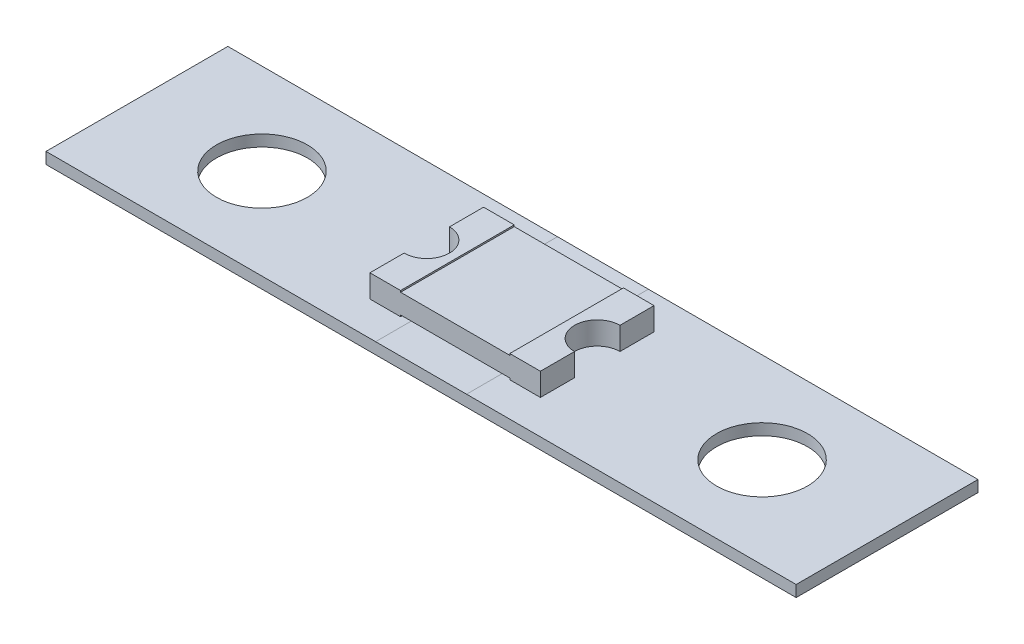
ISO-10303-21;
HEADER;
FILE_DESCRIPTION(('STEP AP214'),'2;1');
FILE_NAME('part.step','',(''),(''),'','','');
FILE_SCHEMA(('AUTOMOTIVE_DESIGN { 1 0 10303 214 1 1 1 1 }'));
ENDSEC;
DATA;
#1=APPLICATION_CONTEXT('core data for automotive mechanical design processes');
#2=APPLICATION_PROTOCOL_DEFINITION('international standard','automotive_design',2000,#1);
#3=PRODUCT_CONTEXT('',#1,'mechanical');
#4=PRODUCT('Part','Part','',(#3));
#5=PRODUCT_RELATED_PRODUCT_CATEGORY('part','',(#4));
#6=PRODUCT_DEFINITION_FORMATION('','',#4);
#7=PRODUCT_DEFINITION_CONTEXT('part definition',#1,'design');
#8=PRODUCT_DEFINITION('design','',#6,#7);
#9=PRODUCT_DEFINITION_SHAPE('','',#8);
#10=(LENGTH_UNIT() NAMED_UNIT(*) SI_UNIT(.MILLI.,.METRE.));
#11=(NAMED_UNIT(*) PLANE_ANGLE_UNIT() SI_UNIT($,.RADIAN.));
#12=(NAMED_UNIT(*) SI_UNIT($,.STERADIAN.) SOLID_ANGLE_UNIT());
#13=UNCERTAINTY_MEASURE_WITH_UNIT(LENGTH_MEASURE(1.E-05),#10,'distance_accuracy_value','');
#14=(GEOMETRIC_REPRESENTATION_CONTEXT(3) GLOBAL_UNCERTAINTY_ASSIGNED_CONTEXT((#13)) GLOBAL_UNIT_ASSIGNED_CONTEXT((#10,
#11,#12)) REPRESENTATION_CONTEXT('',''));
#15=CARTESIAN_POINT('',(0.,0.,0.));
#16=DIRECTION('',(0.,0.,1.));
#17=DIRECTION('',(1.,0.,0.));
#18=AXIS2_PLACEMENT_3D('',#15,#16,#17);
#19=CARTESIAN_POINT('',(0.,1.5,0.));
#20=DIRECTION('',(0.,1.,0.));
#21=DIRECTION('',(0.,0.,1.));
#22=AXIS2_PLACEMENT_3D('',#19,#20,#21);
#23=PLANE('',#22);
#24=DIRECTION('',(0.,0.,1.));
#25=VECTOR('',#24,1.);
#26=CARTESIAN_POINT('',(-2.40178605763674,1.5,0.));
#27=LINE('',#26,#25);
#28=CARTESIAN_POINT('',(-2.40178605763674,1.5,-2.5));
#29=VERTEX_POINT('',#28);
#30=CARTESIAN_POINT('',(-2.40178605763674,1.5,2.5));
#31=VERTEX_POINT('',#30);
#32=EDGE_CURVE('E12',#29,#31,#27,.T.);
#33=ORIENTED_EDGE('',*,*,#32,.F.);
#34=DIRECTION('',(1.,0.,0.));
#35=VECTOR('',#34,1.);
#36=CARTESIAN_POINT('',(0.,1.5,-2.5));
#37=LINE('',#36,#35);
#38=CARTESIAN_POINT('',(-3.75,1.5,-2.5));
#39=VERTEX_POINT('',#38);
#40=EDGE_CURVE('E223',#39,#29,#37,.T.);
#41=ORIENTED_EDGE('',*,*,#40,.F.);
#42=DIRECTION('',(0.,0.,-1.));
#43=VECTOR('',#42,1.);
#44=CARTESIAN_POINT('',(-3.75,1.5,0.));
#45=LINE('',#44,#43);
#46=CARTESIAN_POINT('',(-3.75,1.5,-1.));
#47=VERTEX_POINT('',#46);
#48=EDGE_CURVE('E226',#47,#39,#45,.T.);
#49=ORIENTED_EDGE('',*,*,#48,.F.);
#50=CARTESIAN_POINT('',(-3.75,1.5,0.));
#51=DIRECTION('',(0.,1.,0.));
#52=DIRECTION('',(0.,0.,1.));
#53=AXIS2_PLACEMENT_3D('',#50,#51,#52);
#54=CIRCLE('',#53,1.);
#55=CARTESIAN_POINT('',(-3.75,1.5,1.));
#56=VERTEX_POINT('',#55);
#57=EDGE_CURVE('E229',#56,#47,#54,.T.);
#58=ORIENTED_EDGE('',*,*,#57,.F.);
#59=CARTESIAN_POINT('',(-3.75,1.5,2.5));
#60=VERTEX_POINT('',#59);
#61=EDGE_CURVE('E230',#60,#56,#45,.T.);
#62=ORIENTED_EDGE('',*,*,#61,.F.);
#63=DIRECTION('',(1.,0.,0.));
#64=VECTOR('',#63,1.);
#65=CARTESIAN_POINT('',(0.,1.5,2.5));
#66=LINE('',#65,#64);
#67=EDGE_CURVE('E233',#60,#31,#66,.T.);
#68=ORIENTED_EDGE('',*,*,#67,.T.);
#69=EDGE_LOOP('',(#33,#41,#49,#58,#62,#68));
#70=FACE_BOUND('',#69,.T.);
#71=ADVANCED_FACE('F52',(#70),#23,.T.);
#72=CARTESIAN_POINT('',(0.,0.5,0.));
#73=DIRECTION('',(0.,1.,0.));
#74=DIRECTION('',(0.,0.,1.));
#75=AXIS2_PLACEMENT_3D('',#72,#73,#74);
#76=PLANE('',#75);
#77=DIRECTION('',(1.,0.,0.));
#78=VECTOR('',#77,1.);
#79=CARTESIAN_POINT('',(0.,0.5,-2.5));
#80=LINE('',#79,#78);
#81=CARTESIAN_POINT('',(-3.75,0.5,-2.5));
#82=VERTEX_POINT('',#81);
#83=CARTESIAN_POINT('',(-2.40178605763674,0.5,-2.5));
#84=VERTEX_POINT('',#83);
#85=EDGE_CURVE('E242',#82,#84,#80,.T.);
#86=ORIENTED_EDGE('',*,*,#85,.T.);
#87=DIRECTION('',(0.,0.,1.));
#88=VECTOR('',#87,1.);
#89=CARTESIAN_POINT('',(-2.40178605763674,0.5,0.));
#90=LINE('',#89,#88);
#91=CARTESIAN_POINT('',(-2.40178605763674,0.5,2.5));
#92=VERTEX_POINT('',#91);
#93=EDGE_CURVE('E276',#84,#92,#90,.T.);
#94=ORIENTED_EDGE('',*,*,#93,.T.);
#95=DIRECTION('',(1.,0.,0.));
#96=VECTOR('',#95,1.);
#97=CARTESIAN_POINT('',(0.,0.5,2.5));
#98=LINE('',#97,#96);
#99=CARTESIAN_POINT('',(-3.75,0.5,2.5));
#100=VERTEX_POINT('',#99);
#101=EDGE_CURVE('E252',#100,#92,#98,.T.);
#102=ORIENTED_EDGE('',*,*,#101,.F.);
#103=DIRECTION('',(0.,0.,-1.));
#104=VECTOR('',#103,1.);
#105=CARTESIAN_POINT('',(-3.75,0.5,0.));
#106=LINE('',#105,#104);
#107=CARTESIAN_POINT('',(-3.75,0.5,1.));
#108=VERTEX_POINT('',#107);
#109=EDGE_CURVE('E249',#100,#108,#106,.T.);
#110=ORIENTED_EDGE('',*,*,#109,.T.);
#111=CARTESIAN_POINT('',(-3.75,0.5,0.));
#112=DIRECTION('',(0.,1.,0.));
#113=DIRECTION('',(0.,0.,1.));
#114=AXIS2_PLACEMENT_3D('',#111,#112,#113);
#115=CIRCLE('',#114,1.);
#116=CARTESIAN_POINT('',(-3.75,0.5,-1.));
#117=VERTEX_POINT('',#116);
#118=EDGE_CURVE('E248',#108,#117,#115,.T.);
#119=ORIENTED_EDGE('',*,*,#118,.T.);
#120=EDGE_CURVE('E245',#117,#82,#106,.T.);
#121=ORIENTED_EDGE('',*,*,#120,.T.);
#122=EDGE_LOOP('',(#86,#94,#102,#110,#119,#121));
#123=FACE_BOUND('',#122,.T.);
#124=ADVANCED_FACE('F310',(#123),#76,.F.);
#125=CARTESIAN_POINT('',(3.75,1.5,0.));
#126=DIRECTION('',(0.,-1.,0.));
#127=DIRECTION('',(0.,0.,-1.));
#128=AXIS2_PLACEMENT_3D('',#125,#126,#127);
#129=CYLINDRICAL_SURFACE('',#128,1.);
#130=CARTESIAN_POINT('',(3.75,0.5,0.));
#131=DIRECTION('',(0.,1.,0.));
#132=DIRECTION('',(0.,0.,1.));
#133=AXIS2_PLACEMENT_3D('',#130,#131,#132);
#134=CIRCLE('',#133,1.);
#135=CARTESIAN_POINT('',(3.75,0.5,-1.));
#136=VERTEX_POINT('',#135);
#137=CARTESIAN_POINT('',(3.75,0.5,1.));
#138=VERTEX_POINT('',#137);
#139=EDGE_CURVE('E213',#136,#138,#134,.T.);
#140=ORIENTED_EDGE('',*,*,#139,.F.);
#141=DIRECTION('',(0.,-1.,0.));
#142=VECTOR('',#141,1.);
#143=CARTESIAN_POINT('',(3.75,1.5,-1.));
#144=LINE('',#143,#142);
#145=CARTESIAN_POINT('',(3.75,1.5,-1.));
#146=VERTEX_POINT('',#145);
#147=EDGE_CURVE('E272',#146,#136,#144,.T.);
#148=ORIENTED_EDGE('',*,*,#147,.F.);
#149=CARTESIAN_POINT('',(3.75,1.5,0.));
#150=DIRECTION('',(0.,1.,0.));
#151=DIRECTION('',(0.,0.,1.));
#152=AXIS2_PLACEMENT_3D('',#149,#150,#151);
#153=CIRCLE('',#152,1.);
#154=CARTESIAN_POINT('',(3.75,1.5,1.));
#155=VERTEX_POINT('',#154);
#156=EDGE_CURVE('E214',#146,#155,#153,.T.);
#157=ORIENTED_EDGE('',*,*,#156,.T.);
#158=DIRECTION('',(0.,-1.,0.));
#159=VECTOR('',#158,1.);
#160=CARTESIAN_POINT('',(3.75,1.5,1.));
#161=LINE('',#160,#159);
#162=EDGE_CURVE('E256',#155,#138,#161,.T.);
#163=ORIENTED_EDGE('',*,*,#162,.T.);
#164=EDGE_LOOP('',(#140,#148,#157,#163));
#165=FACE_BOUND('',#164,.T.);
#166=ADVANCED_FACE('F54',(#165),#129,.F.);
#167=CARTESIAN_POINT('',(3.75,1.5,0.));
#168=DIRECTION('',(-1.,0.,0.));
#169=DIRECTION('',(0.,0.,1.));
#170=AXIS2_PLACEMENT_3D('',#167,#168,#169);
#171=PLANE('',#170);
#172=DIRECTION('',(0.,0.,-1.));
#173=VECTOR('',#172,1.);
#174=CARTESIAN_POINT('',(3.75,0.5,0.));
#175=LINE('',#174,#173);
#176=CARTESIAN_POINT('',(3.75,0.5,-2.5));
#177=VERTEX_POINT('',#176);
#178=EDGE_CURVE('E238',#136,#177,#175,.T.);
#179=ORIENTED_EDGE('',*,*,#178,.T.);
#180=DIRECTION('',(0.,-1.,0.));
#181=VECTOR('',#180,1.);
#182=CARTESIAN_POINT('',(3.75,1.5,-2.5));
#183=LINE('',#182,#181);
#184=CARTESIAN_POINT('',(3.75,1.5,-2.5));
#185=VERTEX_POINT('',#184);
#186=EDGE_CURVE('E269',#185,#177,#183,.T.);
#187=ORIENTED_EDGE('',*,*,#186,.F.);
#188=DIRECTION('',(0.,0.,-1.));
#189=VECTOR('',#188,1.);
#190=CARTESIAN_POINT('',(3.75,1.5,0.));
#191=LINE('',#190,#189);
#192=EDGE_CURVE('E217',#146,#185,#191,.T.);
#193=ORIENTED_EDGE('',*,*,#192,.F.);
#194=ORIENTED_EDGE('',*,*,#147,.T.);
#195=EDGE_LOOP('',(#179,#187,#193,#194));
#196=FACE_BOUND('',#195,.T.);
#197=ADVANCED_FACE('F289',(#196),#171,.F.);
#198=CARTESIAN_POINT('',(0.,1.5,-2.5));
#199=DIRECTION('',(0.,0.,-1.));
#200=DIRECTION('',(-1.,0.,0.));
#201=AXIS2_PLACEMENT_3D('',#198,#199,#200);
#202=PLANE('',#201);
#203=DIRECTION('',(0.,1.,0.));
#204=VECTOR('',#203,1.);
#205=CARTESIAN_POINT('',(-2.40178605763674,1.5,-2.5));
#206=LINE('',#205,#204);
#207=CARTESIAN_POINT('',(-2.40178605763674,1.43207417273462,-2.5));
#208=VERTEX_POINT('',#207);
#209=EDGE_CURVE('E208',#208,#29,#206,.T.);
#210=ORIENTED_EDGE('',*,*,#209,.F.);
#211=DIRECTION('',(-1.,0.,0.));
#212=VECTOR('',#211,1.);
#213=CARTESIAN_POINT('',(0.,1.43207417273462,-2.5));
#214=LINE('',#213,#212);
#215=CARTESIAN_POINT('',(2.40178605763674,1.43207417273462,-2.5));
#216=VERTEX_POINT('',#215);
#217=EDGE_CURVE('E172',#216,#208,#214,.T.);
#218=ORIENTED_EDGE('',*,*,#217,.F.);
#219=DIRECTION('',(0.,-1.,0.));
#220=VECTOR('',#219,1.);
#221=CARTESIAN_POINT('',(2.40178605763674,1.5,-2.5));
#222=LINE('',#221,#220);
#223=CARTESIAN_POINT('',(2.40178605763674,1.5,-2.5));
#224=VERTEX_POINT('',#223);
#225=EDGE_CURVE('E206',#224,#216,#222,.T.);
#226=ORIENTED_EDGE('',*,*,#225,.F.);
#227=EDGE_CURVE('E221',#224,#185,#37,.T.);
#228=ORIENTED_EDGE('',*,*,#227,.T.);
#229=ORIENTED_EDGE('',*,*,#186,.T.);
#230=CARTESIAN_POINT('',(2.40178605763674,0.5,-2.5));
#231=VERTEX_POINT('',#230);
#232=EDGE_CURVE('E241',#231,#177,#80,.T.);
#233=ORIENTED_EDGE('',*,*,#232,.F.);
#234=DIRECTION('',(0.,-1.,0.));
#235=VECTOR('',#234,1.);
#236=CARTESIAN_POINT('',(2.40178605763674,1.5,-2.5));
#237=LINE('',#236,#235);
#238=CARTESIAN_POINT('',(2.40178605763674,0.56792582726538,-2.5));
#239=VERTEX_POINT('',#238);
#240=EDGE_CURVE('E75',#239,#231,#237,.T.);
#241=ORIENTED_EDGE('',*,*,#240,.F.);
#242=DIRECTION('',(1.,0.,0.));
#243=VECTOR('',#242,1.);
#244=CARTESIAN_POINT('',(0.,0.56792582726538,-2.5));
#245=LINE('',#244,#243);
#246=CARTESIAN_POINT('',(-2.40178605763674,0.56792582726538,-2.5));
#247=VERTEX_POINT('',#246);
#248=EDGE_CURVE('E210',#247,#239,#245,.T.);
#249=ORIENTED_EDGE('',*,*,#248,.F.);
#250=DIRECTION('',(0.,1.,0.));
#251=VECTOR('',#250,1.);
#252=CARTESIAN_POINT('',(-2.40178605763674,1.5,-2.5));
#253=LINE('',#252,#251);
#254=EDGE_CURVE('E204',#84,#247,#253,.T.);
#255=ORIENTED_EDGE('',*,*,#254,.F.);
#256=ORIENTED_EDGE('',*,*,#85,.F.);
#257=DIRECTION('',(0.,-1.,0.));
#258=VECTOR('',#257,1.);
#259=CARTESIAN_POINT('',(-3.75,1.5,-2.5));
#260=LINE('',#259,#258);
#261=EDGE_CURVE('E267',#39,#82,#260,.T.);
#262=ORIENTED_EDGE('',*,*,#261,.F.);
#263=ORIENTED_EDGE('',*,*,#40,.T.);
#264=EDGE_LOOP('',(#210,#218,#226,#228,#229,#233,#241,#249,#255,#256,#262,#263));
#265=FACE_BOUND('',#264,.T.);
#266=ADVANCED_FACE('F283',(#265),#202,.T.);
#267=CARTESIAN_POINT('',(-3.75,1.5,0.));
#268=DIRECTION('',(-1.,0.,0.));
#269=DIRECTION('',(0.,0.,1.));
#270=AXIS2_PLACEMENT_3D('',#267,#268,#269);
#271=PLANE('',#270);
#272=ORIENTED_EDGE('',*,*,#120,.F.);
#273=DIRECTION('',(0.,-1.,0.));
#274=VECTOR('',#273,1.);
#275=CARTESIAN_POINT('',(-3.75,1.5,-1.));
#276=LINE('',#275,#274);
#277=EDGE_CURVE('E265',#47,#117,#276,.T.);
#278=ORIENTED_EDGE('',*,*,#277,.F.);
#279=ORIENTED_EDGE('',*,*,#48,.T.);
#280=ORIENTED_EDGE('',*,*,#261,.T.);
#281=EDGE_LOOP('',(#272,#278,#279,#280));
#282=FACE_BOUND('',#281,.T.);
#283=ADVANCED_FACE('F316',(#282),#271,.T.);
#284=CARTESIAN_POINT('',(-3.75,1.5,0.));
#285=DIRECTION('',(0.,-1.,0.));
#286=DIRECTION('',(0.,0.,-1.));
#287=AXIS2_PLACEMENT_3D('',#284,#285,#286);
#288=CYLINDRICAL_SURFACE('',#287,1.);
#289=ORIENTED_EDGE('',*,*,#118,.F.);
#290=DIRECTION('',(0.,-1.,0.));
#291=VECTOR('',#290,1.);
#292=CARTESIAN_POINT('',(-3.75,1.5,1.));
#293=LINE('',#292,#291);
#294=EDGE_CURVE('E263',#56,#108,#293,.T.);
#295=ORIENTED_EDGE('',*,*,#294,.F.);
#296=ORIENTED_EDGE('',*,*,#57,.T.);
#297=ORIENTED_EDGE('',*,*,#277,.T.);
#298=EDGE_LOOP('',(#289,#295,#296,#297));
#299=FACE_BOUND('',#298,.T.);
#300=ADVANCED_FACE('F327',(#299),#288,.F.);
#301=ORIENTED_EDGE('',*,*,#109,.F.);
#302=DIRECTION('',(0.,-1.,0.));
#303=VECTOR('',#302,1.);
#304=CARTESIAN_POINT('',(-3.75,1.5,2.5));
#305=LINE('',#304,#303);
#306=EDGE_CURVE('E261',#60,#100,#305,.T.);
#307=ORIENTED_EDGE('',*,*,#306,.F.);
#308=ORIENTED_EDGE('',*,*,#61,.T.);
#309=ORIENTED_EDGE('',*,*,#294,.T.);
#310=EDGE_LOOP('',(#301,#307,#308,#309));
#311=FACE_BOUND('',#310,.T.);
#312=ADVANCED_FACE('F325',(#311),#271,.T.);
#313=CARTESIAN_POINT('',(0.,1.5,2.5));
#314=DIRECTION('',(0.,0.,-1.));
#315=DIRECTION('',(-1.,0.,0.));
#316=AXIS2_PLACEMENT_3D('',#313,#314,#315);
#317=PLANE('',#316);
#318=DIRECTION('',(1.,0.,0.));
#319=VECTOR('',#318,1.);
#320=CARTESIAN_POINT('',(-2.40178605763674,1.43207417273462,2.5));
#321=LINE('',#320,#319);
#322=CARTESIAN_POINT('',(-2.40178605763674,1.43207417273462,2.5));
#323=VERTEX_POINT('',#322);
#324=CARTESIAN_POINT('',(2.40178605763674,1.43207417273462,2.5));
#325=VERTEX_POINT('',#324);
#326=EDGE_CURVE('E170',#323,#325,#321,.T.);
#327=ORIENTED_EDGE('',*,*,#326,.F.);
#328=DIRECTION('',(0.,-1.,0.));
#329=VECTOR('',#328,1.);
#330=CARTESIAN_POINT('',(-2.40178605763674,1.5,2.5));
#331=LINE('',#330,#329);
#332=EDGE_CURVE('E178',#31,#323,#331,.T.);
#333=ORIENTED_EDGE('',*,*,#332,.F.);
#334=ORIENTED_EDGE('',*,*,#67,.F.);
#335=ORIENTED_EDGE('',*,*,#306,.T.);
#336=ORIENTED_EDGE('',*,*,#101,.T.);
#337=DIRECTION('',(0.,-1.,0.));
#338=VECTOR('',#337,1.);
#339=CARTESIAN_POINT('',(-2.40178605763674,0.5,2.5));
#340=LINE('',#339,#338);
#341=CARTESIAN_POINT('',(-2.40178605763674,0.56792582726538,2.5));
#342=VERTEX_POINT('',#341);
#343=EDGE_CURVE('E192',#342,#92,#340,.T.);
#344=ORIENTED_EDGE('',*,*,#343,.F.);
#345=DIRECTION('',(-1.,0.,0.));
#346=VECTOR('',#345,1.);
#347=CARTESIAN_POINT('',(-2.40178605763674,0.56792582726538,2.5));
#348=LINE('',#347,#346);
#349=CARTESIAN_POINT('',(2.40178605763674,0.56792582726538,2.5));
#350=VERTEX_POINT('',#349);
#351=EDGE_CURVE('E197',#350,#342,#348,.T.);
#352=ORIENTED_EDGE('',*,*,#351,.F.);
#353=DIRECTION('',(0.,1.,0.));
#354=VECTOR('',#353,1.);
#355=CARTESIAN_POINT('',(2.40178605763674,0.5,2.5));
#356=LINE('',#355,#354);
#357=CARTESIAN_POINT('',(2.40178605763674,0.5,2.5));
#358=VERTEX_POINT('',#357);
#359=EDGE_CURVE('E194',#358,#350,#356,.T.);
#360=ORIENTED_EDGE('',*,*,#359,.F.);
#361=CARTESIAN_POINT('',(3.75,0.5,2.5));
#362=VERTEX_POINT('',#361);
#363=EDGE_CURVE('E255',#358,#362,#98,.T.);
#364=ORIENTED_EDGE('',*,*,#363,.T.);
#365=DIRECTION('',(0.,-1.,0.));
#366=VECTOR('',#365,1.);
#367=CARTESIAN_POINT('',(3.75,1.5,2.5));
#368=LINE('',#367,#366);
#369=CARTESIAN_POINT('',(3.75,1.5,2.5));
#370=VERTEX_POINT('',#369);
#371=EDGE_CURVE('E258',#370,#362,#368,.T.);
#372=ORIENTED_EDGE('',*,*,#371,.F.);
#373=CARTESIAN_POINT('',(2.40178605763674,1.5,2.5));
#374=VERTEX_POINT('',#373);
#375=EDGE_CURVE('E235',#374,#370,#66,.T.);
#376=ORIENTED_EDGE('',*,*,#375,.F.);
#377=DIRECTION('',(0.,1.,0.));
#378=VECTOR('',#377,1.);
#379=CARTESIAN_POINT('',(2.40178605763674,1.5,2.5));
#380=LINE('',#379,#378);
#381=EDGE_CURVE('E67',#325,#374,#380,.T.);
#382=ORIENTED_EDGE('',*,*,#381,.F.);
#383=EDGE_LOOP('',(#327,#333,#334,#335,#336,#344,#352,#360,#364,#372,#376,#382));
#384=FACE_BOUND('',#383,.T.);
#385=ADVANCED_FACE('F186',(#384),#317,.F.);
#386=EDGE_CURVE('E218',#362,#138,#175,.T.);
#387=ORIENTED_EDGE('',*,*,#386,.T.);
#388=ORIENTED_EDGE('',*,*,#162,.F.);
#389=EDGE_CURVE('E222',#370,#155,#191,.T.);
#390=ORIENTED_EDGE('',*,*,#389,.F.);
#391=ORIENTED_EDGE('',*,*,#371,.T.);
#392=EDGE_LOOP('',(#387,#388,#390,#391));
#393=FACE_BOUND('',#392,.T.);
#394=ADVANCED_FACE('F343',(#393),#171,.F.);
#395=DIRECTION('',(0.,0.,-1.));
#396=VECTOR('',#395,1.);
#397=CARTESIAN_POINT('',(2.40178605763674,1.5,0.));
#398=LINE('',#397,#396);
#399=EDGE_CURVE('E60',#374,#224,#398,.T.);
#400=ORIENTED_EDGE('',*,*,#399,.F.);
#401=ORIENTED_EDGE('',*,*,#375,.T.);
#402=ORIENTED_EDGE('',*,*,#389,.T.);
#403=ORIENTED_EDGE('',*,*,#156,.F.);
#404=ORIENTED_EDGE('',*,*,#192,.T.);
#405=ORIENTED_EDGE('',*,*,#227,.F.);
#406=EDGE_LOOP('',(#400,#401,#402,#403,#404,#405));
#407=FACE_BOUND('',#406,.T.);
#408=ADVANCED_FACE('F284',(#407),#23,.T.);
#409=ORIENTED_EDGE('',*,*,#363,.F.);
#410=DIRECTION('',(0.,0.,-1.));
#411=VECTOR('',#410,1.);
#412=CARTESIAN_POINT('',(2.40178605763674,0.5,0.));
#413=LINE('',#412,#411);
#414=EDGE_CURVE('E274',#358,#231,#413,.T.);
#415=ORIENTED_EDGE('',*,*,#414,.T.);
#416=ORIENTED_EDGE('',*,*,#232,.T.);
#417=ORIENTED_EDGE('',*,*,#178,.F.);
#418=ORIENTED_EDGE('',*,*,#139,.T.);
#419=ORIENTED_EDGE('',*,*,#386,.F.);
#420=EDGE_LOOP('',(#409,#415,#416,#417,#418,#419));
#421=FACE_BOUND('',#420,.T.);
#422=ADVANCED_FACE('F295',(#421),#76,.F.);
#423=CARTESIAN_POINT('',(-2.40178605763674,0.5,-4.));
#424=DIRECTION('',(-1.,0.,0.));
#425=DIRECTION('',(0.,0.,1.));
#426=AXIS2_PLACEMENT_3D('',#423,#424,#425);
#427=PLANE('',#426);
#428=ORIENTED_EDGE('',*,*,#254,.T.);
#429=DIRECTION('',(0.,0.,1.));
#430=VECTOR('',#429,1.);
#431=CARTESIAN_POINT('',(-2.40178605763674,0.56792582726538,-4.));
#432=LINE('',#431,#430);
#433=EDGE_CURVE('E184',#247,#342,#432,.T.);
#434=ORIENTED_EDGE('',*,*,#433,.T.);
#435=ORIENTED_EDGE('',*,*,#343,.T.);
#436=ORIENTED_EDGE('',*,*,#93,.F.);
#437=EDGE_LOOP('',(#428,#434,#435,#436));
#438=FACE_BOUND('',#437,.T.);
#439=ADVANCED_FACE('F348',(#438),#427,.F.);
#440=CARTESIAN_POINT('',(-2.40178605763674,0.56792582726538,-4.));
#441=DIRECTION('',(0.,1.,0.));
#442=DIRECTION('',(0.,0.,1.));
#443=AXIS2_PLACEMENT_3D('',#440,#441,#442);
#444=PLANE('',#443);
#445=ORIENTED_EDGE('',*,*,#248,.T.);
#446=DIRECTION('',(0.,0.,1.));
#447=VECTOR('',#446,1.);
#448=CARTESIAN_POINT('',(2.40178605763674,0.56792582726538,-4.));
#449=LINE('',#448,#447);
#450=EDGE_CURVE('E200',#239,#350,#449,.T.);
#451=ORIENTED_EDGE('',*,*,#450,.T.);
#452=ORIENTED_EDGE('',*,*,#351,.T.);
#453=ORIENTED_EDGE('',*,*,#433,.F.);
#454=EDGE_LOOP('',(#445,#451,#452,#453));
#455=FACE_BOUND('',#454,.T.);
#456=ADVANCED_FACE('F305',(#455),#444,.F.);
#457=CARTESIAN_POINT('',(2.40178605763674,0.5,-4.));
#458=DIRECTION('',(1.,0.,0.));
#459=DIRECTION('',(0.,0.,-1.));
#460=AXIS2_PLACEMENT_3D('',#457,#458,#459);
#461=PLANE('',#460);
#462=ORIENTED_EDGE('',*,*,#240,.T.);
#463=ORIENTED_EDGE('',*,*,#414,.F.);
#464=ORIENTED_EDGE('',*,*,#359,.T.);
#465=ORIENTED_EDGE('',*,*,#450,.F.);
#466=EDGE_LOOP('',(#462,#463,#464,#465));
#467=FACE_BOUND('',#466,.T.);
#468=ADVANCED_FACE('F299',(#467),#461,.F.);
#469=CARTESIAN_POINT('',(-2.40178605763674,1.5,-4.));
#470=DIRECTION('',(-1.,0.,0.));
#471=DIRECTION('',(0.,0.,1.));
#472=AXIS2_PLACEMENT_3D('',#469,#470,#471);
#473=PLANE('',#472);
#474=ORIENTED_EDGE('',*,*,#209,.T.);
#475=ORIENTED_EDGE('',*,*,#32,.T.);
#476=ORIENTED_EDGE('',*,*,#332,.T.);
#477=DIRECTION('',(0.,0.,1.));
#478=VECTOR('',#477,1.);
#479=CARTESIAN_POINT('',(-2.40178605763674,1.43207417273462,-4.));
#480=LINE('',#479,#478);
#481=EDGE_CURVE('E165',#208,#323,#480,.T.);
#482=ORIENTED_EDGE('',*,*,#481,.F.);
#483=EDGE_LOOP('',(#474,#475,#476,#482));
#484=FACE_BOUND('',#483,.T.);
#485=ADVANCED_FACE('F179',(#484),#473,.F.);
#486=CARTESIAN_POINT('',(2.40178605763674,1.5,-4.));
#487=DIRECTION('',(1.,0.,0.));
#488=DIRECTION('',(0.,0.,-1.));
#489=AXIS2_PLACEMENT_3D('',#486,#487,#488);
#490=PLANE('',#489);
#491=ORIENTED_EDGE('',*,*,#225,.T.);
#492=DIRECTION('',(0.,0.,1.));
#493=VECTOR('',#492,1.);
#494=CARTESIAN_POINT('',(2.40178605763674,1.43207417273462,-4.));
#495=LINE('',#494,#493);
#496=EDGE_CURVE('E175',#216,#325,#495,.T.);
#497=ORIENTED_EDGE('',*,*,#496,.T.);
#498=ORIENTED_EDGE('',*,*,#381,.T.);
#499=ORIENTED_EDGE('',*,*,#399,.T.);
#500=EDGE_LOOP('',(#491,#497,#498,#499));
#501=FACE_BOUND('',#500,.T.);
#502=ADVANCED_FACE('F279',(#501),#490,.F.);
#503=CARTESIAN_POINT('',(-2.40178605763674,1.43207417273462,-4.));
#504=DIRECTION('',(0.,-1.,0.));
#505=DIRECTION('',(0.,0.,-1.));
#506=AXIS2_PLACEMENT_3D('',#503,#504,#505);
#507=PLANE('',#506);
#508=ORIENTED_EDGE('',*,*,#217,.T.);
#509=ORIENTED_EDGE('',*,*,#481,.T.);
#510=ORIENTED_EDGE('',*,*,#326,.T.);
#511=ORIENTED_EDGE('',*,*,#496,.F.);
#512=EDGE_LOOP('',(#508,#509,#510,#511));
#513=FACE_BOUND('',#512,.T.);
#514=ADVANCED_FACE('F167',(#513),#507,.F.);
#515=CLOSED_SHELL('',(#71,#124,#166,#197,#266,#283,#300,#312,#385,#394,#408,#422,#439,#456,#468,
#485,#502,#514));
#516=MANIFOLD_SOLID_BREP('B2',#515);
#517=CARTESIAN_POINT('',(0.,0.5,0.));
#518=DIRECTION('',(0.,-1.,0.));
#519=DIRECTION('',(0.,0.,-1.));
#520=AXIS2_PLACEMENT_3D('',#517,#518,#519);
#521=PLANE('',#520);
#522=CARTESIAN_POINT('',(11.,0.5,0.));
#523=DIRECTION('',(0.,1.,0.));
#524=DIRECTION('',(0.,0.,1.));
#525=AXIS2_PLACEMENT_3D('',#522,#523,#524);
#526=CIRCLE('',#525,2.);
#527=CARTESIAN_POINT('',(11.,0.5,2.));
#528=VERTEX_POINT('',#527);
#529=EDGE_CURVE('E574',#528,#528,#526,.T.);
#530=ORIENTED_EDGE('',*,*,#529,.F.);
#531=EDGE_LOOP('',(#530));
#532=FACE_BOUND('',#531,.T.);
#533=DIRECTION('',(0.,0.,-1.));
#534=VECTOR('',#533,1.);
#535=CARTESIAN_POINT('',(2.,0.5,0.));
#536=LINE('',#535,#534);
#537=CARTESIAN_POINT('',(2.,0.5,4.));
#538=VERTEX_POINT('',#537);
#539=CARTESIAN_POINT('',(2.,0.5,-4.));
#540=VERTEX_POINT('',#539);
#541=EDGE_CURVE('E50',#538,#540,#536,.T.);
#542=ORIENTED_EDGE('',*,*,#541,.F.);
#543=DIRECTION('',(1.,0.,0.));
#544=VECTOR('',#543,1.);
#545=CARTESIAN_POINT('',(-16.5,0.5,4.));
#546=LINE('',#545,#544);
#547=CARTESIAN_POINT('',(16.5,0.5,4.));
#548=VERTEX_POINT('',#547);
#549=EDGE_CURVE('E540',#538,#548,#546,.T.);
#550=ORIENTED_EDGE('',*,*,#549,.T.);
#551=DIRECTION('',(0.,0.,-1.));
#552=VECTOR('',#551,1.);
#553=CARTESIAN_POINT('',(16.5,0.5,4.));
#554=LINE('',#553,#552);
#555=CARTESIAN_POINT('',(16.5,0.5,-4.));
#556=VERTEX_POINT('',#555);
#557=EDGE_CURVE('E539',#548,#556,#554,.T.);
#558=ORIENTED_EDGE('',*,*,#557,.T.);
#559=DIRECTION('',(-1.,0.,0.));
#560=VECTOR('',#559,1.);
#561=CARTESIAN_POINT('',(-16.5,0.5,-4.));
#562=LINE('',#561,#560);
#563=EDGE_CURVE('E527',#556,#540,#562,.T.);
#564=ORIENTED_EDGE('',*,*,#563,.T.);
#565=EDGE_LOOP('',(#542,#550,#558,#564));
#566=FACE_BOUND('',#565,.T.);
#567=ADVANCED_FACE('F475',(#532,#566),#521,.F.);
#568=CARTESIAN_POINT('',(-11.,0.5,0.));
#569=DIRECTION('',(0.,1.,0.));
#570=DIRECTION('',(0.,0.,1.));
#571=AXIS2_PLACEMENT_3D('',#568,#569,#570);
#572=CIRCLE('',#571,2.);
#573=CARTESIAN_POINT('',(-11.,0.5,2.));
#574=VERTEX_POINT('',#573);
#575=EDGE_CURVE('E566',#574,#574,#572,.T.);
#576=ORIENTED_EDGE('',*,*,#575,.F.);
#577=EDGE_LOOP('',(#576));
#578=FACE_BOUND('',#577,.T.);
#579=DIRECTION('',(0.,0.,1.));
#580=VECTOR('',#579,1.);
#581=CARTESIAN_POINT('',(-2.,0.5,0.));
#582=LINE('',#581,#580);
#583=CARTESIAN_POINT('',(-2.,0.5,-4.));
#584=VERTEX_POINT('',#583);
#585=CARTESIAN_POINT('',(-2.,0.5,4.));
#586=VERTEX_POINT('',#585);
#587=EDGE_CURVE('E484',#584,#586,#582,.T.);
#588=ORIENTED_EDGE('',*,*,#587,.F.);
#589=CARTESIAN_POINT('',(-16.5,0.5,-4.));
#590=VERTEX_POINT('',#589);
#591=EDGE_CURVE('E537',#584,#590,#562,.T.);
#592=ORIENTED_EDGE('',*,*,#591,.T.);
#593=DIRECTION('',(0.,0.,1.));
#594=VECTOR('',#593,1.);
#595=CARTESIAN_POINT('',(-16.5,0.5,4.));
#596=LINE('',#595,#594);
#597=CARTESIAN_POINT('',(-16.5,0.5,4.));
#598=VERTEX_POINT('',#597);
#599=EDGE_CURVE('E535',#590,#598,#596,.T.);
#600=ORIENTED_EDGE('',*,*,#599,.T.);
#601=EDGE_CURVE('E559',#598,#586,#546,.T.);
#602=ORIENTED_EDGE('',*,*,#601,.T.);
#603=EDGE_LOOP('',(#588,#592,#600,#602));
#604=FACE_BOUND('',#603,.T.);
#605=ADVANCED_FACE('F587',(#578,#604),#521,.F.);
#606=EDGE_CURVE('E569',#586,#538,#546,.T.);
#607=ORIENTED_EDGE('',*,*,#606,.T.);
#608=ORIENTED_EDGE('',*,*,#541,.T.);
#609=EDGE_CURVE('E534',#540,#584,#562,.T.);
#610=ORIENTED_EDGE('',*,*,#609,.T.);
#611=ORIENTED_EDGE('',*,*,#587,.T.);
#612=EDGE_LOOP('',(#607,#608,#610,#611));
#613=FACE_BOUND('',#612,.T.);
#614=ADVANCED_FACE('F589',(#613),#521,.F.);
#615=CARTESIAN_POINT('',(0.,0.,0.));
#616=DIRECTION('',(0.,-1.,0.));
#617=DIRECTION('',(0.,0.,-1.));
#618=AXIS2_PLACEMENT_3D('',#615,#616,#617);
#619=PLANE('',#618);
#620=CARTESIAN_POINT('',(-11.,0.,0.));
#621=DIRECTION('',(0.,1.,0.));
#622=DIRECTION('',(0.,0.,1.));
#623=AXIS2_PLACEMENT_3D('',#620,#621,#622);
#624=CIRCLE('',#623,2.);
#625=CARTESIAN_POINT('',(-11.,0.,2.));
#626=VERTEX_POINT('',#625);
#627=EDGE_CURVE('E571',#626,#626,#624,.T.);
#628=ORIENTED_EDGE('',*,*,#627,.T.);
#629=EDGE_LOOP('',(#628));
#630=FACE_BOUND('',#629,.T.);
#631=DIRECTION('',(0.,0.,-1.));
#632=VECTOR('',#631,1.);
#633=CARTESIAN_POINT('',(16.5,0.,4.));
#634=LINE('',#633,#632);
#635=CARTESIAN_POINT('',(16.5,0.,4.));
#636=VERTEX_POINT('',#635);
#637=CARTESIAN_POINT('',(16.5,0.,-4.));
#638=VERTEX_POINT('',#637);
#639=EDGE_CURVE('E547',#636,#638,#634,.T.);
#640=ORIENTED_EDGE('',*,*,#639,.F.);
#641=DIRECTION('',(1.,0.,0.));
#642=VECTOR('',#641,1.);
#643=CARTESIAN_POINT('',(-16.5,0.,4.));
#644=LINE('',#643,#642);
#645=CARTESIAN_POINT('',(-16.5,0.,4.));
#646=VERTEX_POINT('',#645);
#647=EDGE_CURVE('E544',#646,#636,#644,.T.);
#648=ORIENTED_EDGE('',*,*,#647,.F.);
#649=DIRECTION('',(0.,0.,1.));
#650=VECTOR('',#649,1.);
#651=CARTESIAN_POINT('',(-16.5,0.,4.));
#652=LINE('',#651,#650);
#653=CARTESIAN_POINT('',(-16.5,0.,-4.));
#654=VERTEX_POINT('',#653);
#655=EDGE_CURVE('E561',#654,#646,#652,.T.);
#656=ORIENTED_EDGE('',*,*,#655,.F.);
#657=DIRECTION('',(-1.,0.,0.));
#658=VECTOR('',#657,1.);
#659=CARTESIAN_POINT('',(-16.5,0.,-4.));
#660=LINE('',#659,#658);
#661=EDGE_CURVE('E563',#638,#654,#660,.T.);
#662=ORIENTED_EDGE('',*,*,#661,.F.);
#663=EDGE_LOOP('',(#640,#648,#656,#662));
#664=FACE_BOUND('',#663,.T.);
#665=CARTESIAN_POINT('',(11.,0.,0.));
#666=DIRECTION('',(0.,1.,0.));
#667=DIRECTION('',(0.,0.,1.));
#668=AXIS2_PLACEMENT_3D('',#665,#666,#667);
#669=CIRCLE('',#668,2.);
#670=CARTESIAN_POINT('',(11.,0.,2.));
#671=VERTEX_POINT('',#670);
#672=EDGE_CURVE('E577',#671,#671,#669,.T.);
#673=ORIENTED_EDGE('',*,*,#672,.T.);
#674=EDGE_LOOP('',(#673));
#675=FACE_BOUND('',#674,.T.);
#676=ADVANCED_FACE('F597',(#630,#664,#675),#619,.T.);
#677=CARTESIAN_POINT('',(16.5,0.5,4.));
#678=DIRECTION('',(-1.,0.,0.));
#679=DIRECTION('',(0.,0.,1.));
#680=AXIS2_PLACEMENT_3D('',#677,#678,#679);
#681=PLANE('',#680);
#682=ORIENTED_EDGE('',*,*,#639,.T.);
#683=DIRECTION('',(0.,-1.,0.));
#684=VECTOR('',#683,1.);
#685=CARTESIAN_POINT('',(16.5,0.5,-4.));
#686=LINE('',#685,#684);
#687=EDGE_CURVE('E531',#556,#638,#686,.T.);
#688=ORIENTED_EDGE('',*,*,#687,.F.);
#689=ORIENTED_EDGE('',*,*,#557,.F.);
#690=DIRECTION('',(0.,-1.,0.));
#691=VECTOR('',#690,1.);
#692=CARTESIAN_POINT('',(16.5,0.5,4.));
#693=LINE('',#692,#691);
#694=EDGE_CURVE('E557',#548,#636,#693,.T.);
#695=ORIENTED_EDGE('',*,*,#694,.T.);
#696=EDGE_LOOP('',(#682,#688,#689,#695));
#697=FACE_BOUND('',#696,.T.);
#698=ADVANCED_FACE('F477',(#697),#681,.F.);
#699=CARTESIAN_POINT('',(-16.5,0.5,-4.));
#700=DIRECTION('',(0.,0.,1.));
#701=DIRECTION('',(1.,0.,0.));
#702=AXIS2_PLACEMENT_3D('',#699,#700,#701);
#703=PLANE('',#702);
#704=ORIENTED_EDGE('',*,*,#661,.T.);
#705=DIRECTION('',(0.,-1.,0.));
#706=VECTOR('',#705,1.);
#707=CARTESIAN_POINT('',(-16.5,0.5,-4.));
#708=LINE('',#707,#706);
#709=EDGE_CURVE('E548',#590,#654,#708,.T.);
#710=ORIENTED_EDGE('',*,*,#709,.F.);
#711=ORIENTED_EDGE('',*,*,#591,.F.);
#712=ORIENTED_EDGE('',*,*,#609,.F.);
#713=ORIENTED_EDGE('',*,*,#563,.F.);
#714=ORIENTED_EDGE('',*,*,#687,.T.);
#715=EDGE_LOOP('',(#704,#710,#711,#712,#713,#714));
#716=FACE_BOUND('',#715,.T.);
#717=ADVANCED_FACE('F529',(#716),#703,.F.);
#718=CARTESIAN_POINT('',(-16.5,0.5,4.));
#719=DIRECTION('',(1.,0.,0.));
#720=DIRECTION('',(0.,0.,-1.));
#721=AXIS2_PLACEMENT_3D('',#718,#719,#720);
#722=PLANE('',#721);
#723=ORIENTED_EDGE('',*,*,#655,.T.);
#724=DIRECTION('',(0.,-1.,0.));
#725=VECTOR('',#724,1.);
#726=CARTESIAN_POINT('',(-16.5,0.5,4.));
#727=LINE('',#726,#725);
#728=EDGE_CURVE('E552',#598,#646,#727,.T.);
#729=ORIENTED_EDGE('',*,*,#728,.F.);
#730=ORIENTED_EDGE('',*,*,#599,.F.);
#731=ORIENTED_EDGE('',*,*,#709,.T.);
#732=EDGE_LOOP('',(#723,#729,#730,#731));
#733=FACE_BOUND('',#732,.T.);
#734=ADVANCED_FACE('F610',(#733),#722,.F.);
#735=CARTESIAN_POINT('',(-16.5,0.5,4.));
#736=DIRECTION('',(0.,0.,-1.));
#737=DIRECTION('',(-1.,0.,0.));
#738=AXIS2_PLACEMENT_3D('',#735,#736,#737);
#739=PLANE('',#738);
#740=ORIENTED_EDGE('',*,*,#647,.T.);
#741=ORIENTED_EDGE('',*,*,#694,.F.);
#742=ORIENTED_EDGE('',*,*,#549,.F.);
#743=ORIENTED_EDGE('',*,*,#606,.F.);
#744=ORIENTED_EDGE('',*,*,#601,.F.);
#745=ORIENTED_EDGE('',*,*,#728,.T.);
#746=EDGE_LOOP('',(#740,#741,#742,#743,#744,#745));
#747=FACE_BOUND('',#746,.T.);
#748=ADVANCED_FACE('F604',(#747),#739,.F.);
#749=CARTESIAN_POINT('',(-11.,0.5,0.));
#750=DIRECTION('',(0.,-1.,0.));
#751=DIRECTION('',(0.,0.,-1.));
#752=AXIS2_PLACEMENT_3D('',#749,#750,#751);
#753=CYLINDRICAL_SURFACE('',#752,2.);
#754=ORIENTED_EDGE('',*,*,#575,.T.);
#755=EDGE_LOOP('',(#754));
#756=FACE_BOUND('',#755,.T.);
#757=ORIENTED_EDGE('',*,*,#627,.F.);
#758=EDGE_LOOP('',(#757));
#759=FACE_BOUND('',#758,.T.);
#760=ADVANCED_FACE('F617',(#756,#759),#753,.F.);
#761=CARTESIAN_POINT('',(11.,0.5,0.));
#762=DIRECTION('',(0.,-1.,0.));
#763=DIRECTION('',(0.,0.,-1.));
#764=AXIS2_PLACEMENT_3D('',#761,#762,#763);
#765=CYLINDRICAL_SURFACE('',#764,2.);
#766=ORIENTED_EDGE('',*,*,#529,.T.);
#767=EDGE_LOOP('',(#766));
#768=FACE_BOUND('',#767,.T.);
#769=ORIENTED_EDGE('',*,*,#672,.F.);
#770=EDGE_LOOP('',(#769));
#771=FACE_BOUND('',#770,.T.);
#772=ADVANCED_FACE('F583',(#768,#771),#765,.F.);
#773=CLOSED_SHELL('',(#567,#605,#614,#676,#698,#717,#734,#748,#760,#772));
#774=MANIFOLD_SOLID_BREP('B6',#773);
#775=ADVANCED_BREP_SHAPE_REPRESENTATION('',(#18,#516,#774),#14);
#776=SHAPE_DEFINITION_REPRESENTATION(#9,#775);
ENDSEC;
END-ISO-10303-21;
